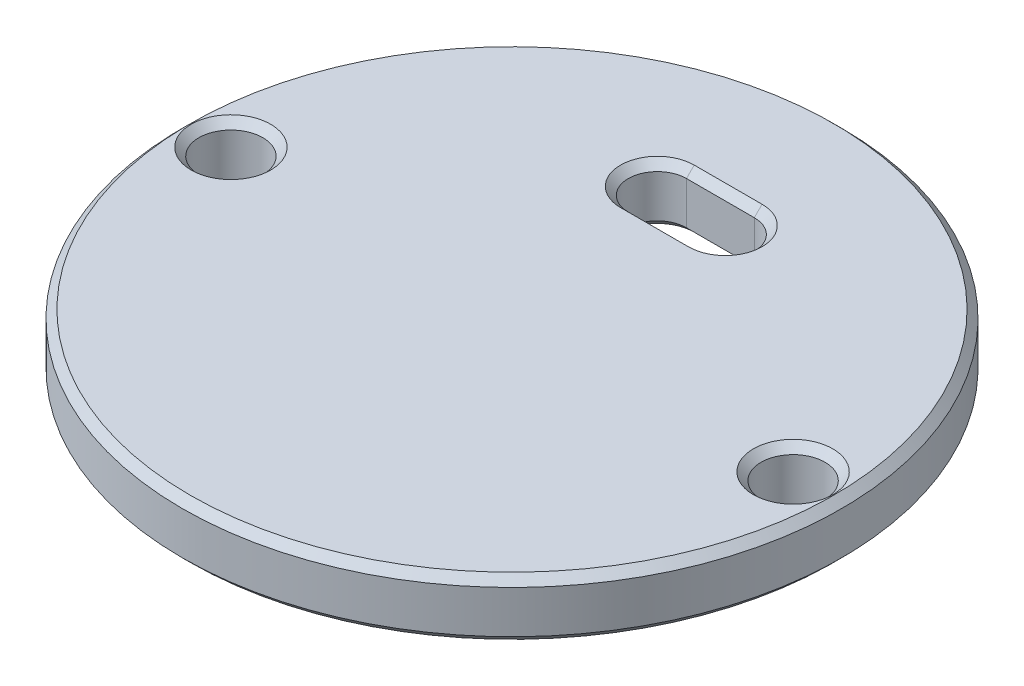
ISO-10303-21;
HEADER;
FILE_DESCRIPTION(('STEP AP214'),'2;1');
FILE_NAME('part.step','',(''),(''),'','','');
FILE_SCHEMA(('AUTOMOTIVE_DESIGN { 1 0 10303 214 1 1 1 1 }'));
ENDSEC;
DATA;
#1=APPLICATION_CONTEXT('core data for automotive mechanical design processes');
#2=APPLICATION_PROTOCOL_DEFINITION('international standard','automotive_design',2000,#1);
#3=PRODUCT_CONTEXT('',#1,'mechanical');
#4=PRODUCT('Part','Part','',(#3));
#5=PRODUCT_RELATED_PRODUCT_CATEGORY('part','',(#4));
#6=PRODUCT_DEFINITION_FORMATION('','',#4);
#7=PRODUCT_DEFINITION_CONTEXT('part definition',#1,'design');
#8=PRODUCT_DEFINITION('design','',#6,#7);
#9=PRODUCT_DEFINITION_SHAPE('','',#8);
#10=(LENGTH_UNIT() NAMED_UNIT(*) SI_UNIT(.MILLI.,.METRE.));
#11=(NAMED_UNIT(*) PLANE_ANGLE_UNIT() SI_UNIT($,.RADIAN.));
#12=(NAMED_UNIT(*) SI_UNIT($,.STERADIAN.) SOLID_ANGLE_UNIT());
#13=UNCERTAINTY_MEASURE_WITH_UNIT(LENGTH_MEASURE(1.E-05),#10,'distance_accuracy_value','');
#14=(GEOMETRIC_REPRESENTATION_CONTEXT(3) GLOBAL_UNCERTAINTY_ASSIGNED_CONTEXT((#13)) GLOBAL_UNIT_ASSIGNED_CONTEXT((#10,
#11,#12)) REPRESENTATION_CONTEXT('',''));
#15=CARTESIAN_POINT('',(0.,0.,0.));
#16=DIRECTION('',(0.,0.,1.));
#17=DIRECTION('',(1.,0.,0.));
#18=AXIS2_PLACEMENT_3D('',#15,#16,#17);
#19=CARTESIAN_POINT('',(0.,3.,0.));
#20=DIRECTION('',(0.,1.,0.));
#21=DIRECTION('',(0.,0.,1.));
#22=AXIS2_PLACEMENT_3D('',#19,#20,#21);
#23=PLANE('',#22);
#24=CARTESIAN_POINT('',(14.5,3.,0.));
#25=DIRECTION('',(0.,1.,0.));
#26=DIRECTION('',(0.,0.,1.));
#27=AXIS2_PLACEMENT_3D('',#24,#25,#26);
#28=CIRCLE('',#27,2.05);
#29=CARTESIAN_POINT('',(14.5,3.,2.05));
#30=VERTEX_POINT('',#29);
#31=EDGE_CURVE('E174',#30,#30,#28,.F.);
#32=ORIENTED_EDGE('',*,*,#31,.T.);
#33=EDGE_LOOP('',(#32));
#34=FACE_BOUND('',#33,.T.);
#35=CARTESIAN_POINT('',(1.75,3.,-9.25));
#36=DIRECTION('',(0.,1.,0.));
#37=DIRECTION('',(0.,0.,1.));
#38=AXIS2_PLACEMENT_3D('',#35,#36,#37);
#39=CIRCLE('',#38,1.90000000000002);
#40=CARTESIAN_POINT('',(1.75,3.,-11.15));
#41=VERTEX_POINT('',#40);
#42=CARTESIAN_POINT('',(1.75,3.,-7.34999999999998));
#43=VERTEX_POINT('',#42);
#44=EDGE_CURVE('E180',#41,#43,#39,.F.);
#45=ORIENTED_EDGE('',*,*,#44,.T.);
#46=DIRECTION('',(-1.,0.,0.));
#47=VECTOR('',#46,1.);
#48=CARTESIAN_POINT('',(0.,3.,-7.34999999999998));
#49=LINE('',#48,#47);
#50=CARTESIAN_POINT('',(-1.75,3.,-7.34999999999998));
#51=VERTEX_POINT('',#50);
#52=EDGE_CURVE('E177',#43,#51,#49,.T.);
#53=ORIENTED_EDGE('',*,*,#52,.T.);
#54=CARTESIAN_POINT('',(-1.75,3.,-9.25));
#55=DIRECTION('',(0.,1.,0.));
#56=DIRECTION('',(0.,0.,1.));
#57=AXIS2_PLACEMENT_3D('',#54,#55,#56);
#58=CIRCLE('',#57,1.90000000000002);
#59=CARTESIAN_POINT('',(-1.75,3.,-11.15));
#60=VERTEX_POINT('',#59);
#61=EDGE_CURVE('E182',#51,#60,#58,.F.);
#62=ORIENTED_EDGE('',*,*,#61,.T.);
#63=DIRECTION('',(1.,0.,0.));
#64=VECTOR('',#63,1.);
#65=CARTESIAN_POINT('',(0.,3.,-11.15));
#66=LINE('',#65,#64);
#67=EDGE_CURVE('E184',#60,#41,#66,.T.);
#68=ORIENTED_EDGE('',*,*,#67,.T.);
#69=EDGE_LOOP('',(#45,#53,#62,#68));
#70=FACE_BOUND('',#69,.T.);
#71=CARTESIAN_POINT('',(-14.5,3.,0.));
#72=DIRECTION('',(0.,1.,0.));
#73=DIRECTION('',(0.,0.,1.));
#74=AXIS2_PLACEMENT_3D('',#71,#72,#73);
#75=CIRCLE('',#74,2.05000000000001);
#76=CARTESIAN_POINT('',(-14.5,3.,2.05000000000001));
#77=VERTEX_POINT('',#76);
#78=EDGE_CURVE('E186',#77,#77,#75,.F.);
#79=ORIENTED_EDGE('',*,*,#78,.T.);
#80=EDGE_LOOP('',(#79));
#81=FACE_BOUND('',#80,.T.);
#82=CARTESIAN_POINT('',(0.,3.,0.));
#83=DIRECTION('',(0.,1.,0.));
#84=DIRECTION('',(0.,0.,1.));
#85=AXIS2_PLACEMENT_3D('',#82,#83,#84);
#86=CIRCLE('',#85,16.6);
#87=CARTESIAN_POINT('',(0.,3.,16.6));
#88=VERTEX_POINT('',#87);
#89=EDGE_CURVE('E189',#88,#88,#86,.T.);
#90=ORIENTED_EDGE('',*,*,#89,.T.);
#91=EDGE_LOOP('',(#90));
#92=FACE_BOUND('',#91,.T.);
#93=ADVANCED_FACE('F40',(#34,#70,#81,#92),#23,.T.);
#94=CARTESIAN_POINT('',(0.,0.,0.));
#95=DIRECTION('',(0.,1.,0.));
#96=DIRECTION('',(0.,0.,1.));
#97=AXIS2_PLACEMENT_3D('',#94,#95,#96);
#98=PLANE('',#97);
#99=CARTESIAN_POINT('',(14.5,0.,0.));
#100=DIRECTION('',(0.,1.,0.));
#101=DIRECTION('',(0.,0.,1.));
#102=AXIS2_PLACEMENT_3D('',#99,#100,#101);
#103=CIRCLE('',#102,2.05);
#104=CARTESIAN_POINT('',(14.5,0.,2.05));
#105=VERTEX_POINT('',#104);
#106=EDGE_CURVE('E198',#105,#105,#103,.T.);
#107=ORIENTED_EDGE('',*,*,#106,.T.);
#108=EDGE_LOOP('',(#107));
#109=FACE_BOUND('',#108,.T.);
#110=CARTESIAN_POINT('',(-1.75,0.,-9.25));
#111=DIRECTION('',(0.,1.,0.));
#112=DIRECTION('',(0.,0.,1.));
#113=AXIS2_PLACEMENT_3D('',#110,#111,#112);
#114=CIRCLE('',#113,1.89999999999999);
#115=CARTESIAN_POINT('',(-1.75,0.,-11.15));
#116=VERTEX_POINT('',#115);
#117=CARTESIAN_POINT('',(-1.75,0.,-7.35000000000001));
#118=VERTEX_POINT('',#117);
#119=EDGE_CURVE('E121',#116,#118,#114,.T.);
#120=ORIENTED_EDGE('',*,*,#119,.T.);
#121=DIRECTION('',(1.,0.,0.));
#122=VECTOR('',#121,1.);
#123=CARTESIAN_POINT('',(1.75,0.,-7.35000000000001));
#124=LINE('',#123,#122);
#125=CARTESIAN_POINT('',(1.75,0.,-7.35000000000001));
#126=VERTEX_POINT('',#125);
#127=EDGE_CURVE('E117',#118,#126,#124,.T.);
#128=ORIENTED_EDGE('',*,*,#127,.T.);
#129=CARTESIAN_POINT('',(1.75,0.,-9.25));
#130=DIRECTION('',(0.,1.,0.));
#131=DIRECTION('',(0.,0.,1.));
#132=AXIS2_PLACEMENT_3D('',#129,#130,#131);
#133=CIRCLE('',#132,1.89999999999999);
#134=CARTESIAN_POINT('',(1.75,0.,-11.15));
#135=VERTEX_POINT('',#134);
#136=EDGE_CURVE('E110',#126,#135,#133,.T.);
#137=ORIENTED_EDGE('',*,*,#136,.T.);
#138=DIRECTION('',(-1.,0.,0.));
#139=VECTOR('',#138,1.);
#140=CARTESIAN_POINT('',(-1.75,0.,-11.15));
#141=LINE('',#140,#139);
#142=EDGE_CURVE('E114',#135,#116,#141,.T.);
#143=ORIENTED_EDGE('',*,*,#142,.T.);
#144=EDGE_LOOP('',(#120,#128,#137,#143));
#145=FACE_BOUND('',#144,.T.);
#146=CARTESIAN_POINT('',(-14.5,0.,0.));
#147=DIRECTION('',(0.,1.,0.));
#148=DIRECTION('',(0.,0.,1.));
#149=AXIS2_PLACEMENT_3D('',#146,#147,#148);
#150=CIRCLE('',#149,2.05);
#151=CARTESIAN_POINT('',(-14.5,0.,2.05));
#152=VERTEX_POINT('',#151);
#153=EDGE_CURVE('E131',#152,#152,#150,.T.);
#154=ORIENTED_EDGE('',*,*,#153,.T.);
#155=EDGE_LOOP('',(#154));
#156=FACE_BOUND('',#155,.T.);
#157=CARTESIAN_POINT('',(0.,0.,0.));
#158=DIRECTION('',(0.,1.,0.));
#159=DIRECTION('',(0.,0.,1.));
#160=AXIS2_PLACEMENT_3D('',#157,#158,#159);
#161=CIRCLE('',#160,16.6);
#162=CARTESIAN_POINT('',(0.,0.,16.6));
#163=VERTEX_POINT('',#162);
#164=EDGE_CURVE('E205',#163,#163,#161,.F.);
#165=ORIENTED_EDGE('',*,*,#164,.T.);
#166=EDGE_LOOP('',(#165));
#167=FACE_BOUND('',#166,.T.);
#168=ADVANCED_FACE('F112',(#109,#145,#156,#167),#98,.F.);
#169=CARTESIAN_POINT('',(0.,3.,0.));
#170=DIRECTION('',(0.,-1.,0.));
#171=DIRECTION('',(0.,0.,-1.));
#172=AXIS2_PLACEMENT_3D('',#169,#170,#171);
#173=CYLINDRICAL_SURFACE('',#172,17.);
#174=CARTESIAN_POINT('',(0.,0.400000000000001,0.));
#175=DIRECTION('',(0.,1.,0.));
#176=DIRECTION('',(0.,0.,1.));
#177=AXIS2_PLACEMENT_3D('',#174,#175,#176);
#178=CIRCLE('',#177,17.);
#179=CARTESIAN_POINT('',(0.,0.400000000000001,17.));
#180=VERTEX_POINT('',#179);
#181=EDGE_CURVE('E11',#180,#180,#178,.T.);
#182=ORIENTED_EDGE('',*,*,#181,.T.);
#183=EDGE_LOOP('',(#182));
#184=FACE_BOUND('',#183,.T.);
#185=CARTESIAN_POINT('',(0.,2.60000000000001,0.));
#186=DIRECTION('',(0.,1.,0.));
#187=DIRECTION('',(0.,0.,1.));
#188=AXIS2_PLACEMENT_3D('',#185,#186,#187);
#189=CIRCLE('',#188,17.);
#190=CARTESIAN_POINT('',(0.,2.60000000000001,17.));
#191=VERTEX_POINT('',#190);
#192=EDGE_CURVE('E50',#191,#191,#189,.F.);
#193=ORIENTED_EDGE('',*,*,#192,.T.);
#194=EDGE_LOOP('',(#193));
#195=FACE_BOUND('',#194,.T.);
#196=ADVANCED_FACE('F244',(#184,#195),#173,.T.);
#197=CARTESIAN_POINT('',(1.75,3.,-9.25));
#198=DIRECTION('',(0.,-1.,0.));
#199=DIRECTION('',(0.,0.,-1.));
#200=AXIS2_PLACEMENT_3D('',#197,#198,#199);
#201=CYLINDRICAL_SURFACE('',#200,1.5);
#202=DIRECTION('',(0.,-1.,0.));
#203=VECTOR('',#202,1.);
#204=CARTESIAN_POINT('',(1.75,3.,-7.75));
#205=LINE('',#204,#203);
#206=CARTESIAN_POINT('',(1.75,2.59999999999999,-7.75));
#207=VERTEX_POINT('',#206);
#208=CARTESIAN_POINT('',(1.75,0.399999999999998,-7.75));
#209=VERTEX_POINT('',#208);
#210=EDGE_CURVE('E144',#207,#209,#205,.T.);
#211=ORIENTED_EDGE('',*,*,#210,.F.);
#212=CARTESIAN_POINT('',(1.75,2.59999999999999,-9.25));
#213=DIRECTION('',(0.,1.,0.));
#214=DIRECTION('',(0.,0.,1.));
#215=AXIS2_PLACEMENT_3D('',#212,#213,#214);
#216=CIRCLE('',#215,1.5);
#217=CARTESIAN_POINT('',(1.75,2.59999999999999,-10.75));
#218=VERTEX_POINT('',#217);
#219=EDGE_CURVE('E165',#207,#218,#216,.T.);
#220=ORIENTED_EDGE('',*,*,#219,.T.);
#221=DIRECTION('',(0.,-1.,0.));
#222=VECTOR('',#221,1.);
#223=CARTESIAN_POINT('',(1.75,3.,-10.75));
#224=LINE('',#223,#222);
#225=CARTESIAN_POINT('',(1.75,0.399999999999998,-10.75));
#226=VERTEX_POINT('',#225);
#227=EDGE_CURVE('E208',#218,#226,#224,.T.);
#228=ORIENTED_EDGE('',*,*,#227,.T.);
#229=CARTESIAN_POINT('',(1.75,0.399999999999998,-9.25));
#230=DIRECTION('',(0.,1.,0.));
#231=DIRECTION('',(0.,0.,1.));
#232=AXIS2_PLACEMENT_3D('',#229,#230,#231);
#233=CIRCLE('',#232,1.5);
#234=EDGE_CURVE('E134',#226,#209,#233,.F.);
#235=ORIENTED_EDGE('',*,*,#234,.T.);
#236=EDGE_LOOP('',(#211,#220,#228,#235));
#237=FACE_BOUND('',#236,.T.);
#238=ADVANCED_FACE('F249',(#237),#201,.F.);
#239=CARTESIAN_POINT('',(-1.75,3.,-10.75));
#240=DIRECTION('',(0.,0.,1.));
#241=DIRECTION('',(1.,0.,0.));
#242=AXIS2_PLACEMENT_3D('',#239,#240,#241);
#243=PLANE('',#242);
#244=ORIENTED_EDGE('',*,*,#227,.F.);
#245=DIRECTION('',(-1.,0.,0.));
#246=VECTOR('',#245,1.);
#247=CARTESIAN_POINT('',(-1.75,2.59999999999999,-10.75));
#248=LINE('',#247,#246);
#249=CARTESIAN_POINT('',(-1.75,2.59999999999999,-10.75));
#250=VERTEX_POINT('',#249);
#251=EDGE_CURVE('E65',#218,#250,#248,.T.);
#252=ORIENTED_EDGE('',*,*,#251,.T.);
#253=DIRECTION('',(0.,-1.,0.));
#254=VECTOR('',#253,1.);
#255=CARTESIAN_POINT('',(-1.75,3.,-10.75));
#256=LINE('',#255,#254);
#257=CARTESIAN_POINT('',(-1.75,0.399999999999998,-10.75));
#258=VERTEX_POINT('',#257);
#259=EDGE_CURVE('E211',#250,#258,#256,.T.);
#260=ORIENTED_EDGE('',*,*,#259,.T.);
#261=DIRECTION('',(1.,0.,0.));
#262=VECTOR('',#261,1.);
#263=CARTESIAN_POINT('',(1.75,0.399999999999998,-10.75));
#264=LINE('',#263,#262);
#265=EDGE_CURVE('E160',#258,#226,#264,.T.);
#266=ORIENTED_EDGE('',*,*,#265,.T.);
#267=EDGE_LOOP('',(#244,#252,#260,#266));
#268=FACE_BOUND('',#267,.T.);
#269=ADVANCED_FACE('F455',(#268),#243,.T.);
#270=CARTESIAN_POINT('',(-1.75,3.,-9.25));
#271=DIRECTION('',(0.,-1.,0.));
#272=DIRECTION('',(0.,0.,-1.));
#273=AXIS2_PLACEMENT_3D('',#270,#271,#272);
#274=CYLINDRICAL_SURFACE('',#273,1.5);
#275=ORIENTED_EDGE('',*,*,#259,.F.);
#276=CARTESIAN_POINT('',(-1.75,2.59999999999999,-9.25));
#277=DIRECTION('',(0.,1.,0.));
#278=DIRECTION('',(0.,0.,1.));
#279=AXIS2_PLACEMENT_3D('',#276,#277,#278);
#280=CIRCLE('',#279,1.5);
#281=CARTESIAN_POINT('',(-1.75,2.59999999999999,-7.75));
#282=VERTEX_POINT('',#281);
#283=EDGE_CURVE('E162',#250,#282,#280,.T.);
#284=ORIENTED_EDGE('',*,*,#283,.T.);
#285=DIRECTION('',(0.,-1.,0.));
#286=VECTOR('',#285,1.);
#287=CARTESIAN_POINT('',(-1.75,3.,-7.75));
#288=LINE('',#287,#286);
#289=CARTESIAN_POINT('',(-1.75,0.399999999999998,-7.75));
#290=VERTEX_POINT('',#289);
#291=EDGE_CURVE('E213',#282,#290,#288,.T.);
#292=ORIENTED_EDGE('',*,*,#291,.T.);
#293=CARTESIAN_POINT('',(-1.75,0.399999999999998,-9.25));
#294=DIRECTION('',(0.,1.,0.));
#295=DIRECTION('',(0.,0.,1.));
#296=AXIS2_PLACEMENT_3D('',#293,#294,#295);
#297=CIRCLE('',#296,1.5);
#298=EDGE_CURVE('E58',#290,#258,#297,.F.);
#299=ORIENTED_EDGE('',*,*,#298,.T.);
#300=EDGE_LOOP('',(#275,#284,#292,#299));
#301=FACE_BOUND('',#300,.T.);
#302=ADVANCED_FACE('F446',(#301),#274,.F.);
#303=CARTESIAN_POINT('',(-1.75,3.,-7.75));
#304=DIRECTION('',(0.,0.,-1.));
#305=DIRECTION('',(-1.,0.,0.));
#306=AXIS2_PLACEMENT_3D('',#303,#304,#305);
#307=PLANE('',#306);
#308=ORIENTED_EDGE('',*,*,#291,.F.);
#309=DIRECTION('',(1.,0.,0.));
#310=VECTOR('',#309,1.);
#311=CARTESIAN_POINT('',(-1.75,2.59999999999999,-7.75));
#312=LINE('',#311,#310);
#313=EDGE_CURVE('E168',#282,#207,#312,.T.);
#314=ORIENTED_EDGE('',*,*,#313,.T.);
#315=ORIENTED_EDGE('',*,*,#210,.T.);
#316=DIRECTION('',(-1.,0.,0.));
#317=VECTOR('',#316,1.);
#318=CARTESIAN_POINT('',(-1.75,0.399999999999998,-7.75));
#319=LINE('',#318,#317);
#320=EDGE_CURVE('E171',#209,#290,#319,.T.);
#321=ORIENTED_EDGE('',*,*,#320,.T.);
#322=EDGE_LOOP('',(#308,#314,#315,#321));
#323=FACE_BOUND('',#322,.T.);
#324=ADVANCED_FACE('F220',(#323),#307,.T.);
#325=CARTESIAN_POINT('',(-14.5,3.,0.));
#326=DIRECTION('',(0.,-1.,0.));
#327=DIRECTION('',(0.,0.,-1.));
#328=AXIS2_PLACEMENT_3D('',#325,#326,#327);
#329=CYLINDRICAL_SURFACE('',#328,1.65);
#330=CARTESIAN_POINT('',(-14.5,0.399999999999997,0.));
#331=DIRECTION('',(0.,1.,0.));
#332=DIRECTION('',(0.,0.,1.));
#333=AXIS2_PLACEMENT_3D('',#330,#331,#332);
#334=CIRCLE('',#333,1.65);
#335=CARTESIAN_POINT('',(-14.5,0.399999999999997,1.65));
#336=VERTEX_POINT('',#335);
#337=EDGE_CURVE('E153',#336,#336,#334,.F.);
#338=ORIENTED_EDGE('',*,*,#337,.T.);
#339=EDGE_LOOP('',(#338));
#340=FACE_BOUND('',#339,.T.);
#341=CARTESIAN_POINT('',(-14.5,2.59999999999999,0.));
#342=DIRECTION('',(0.,1.,0.));
#343=DIRECTION('',(0.,0.,1.));
#344=AXIS2_PLACEMENT_3D('',#341,#342,#343);
#345=CIRCLE('',#344,1.65);
#346=CARTESIAN_POINT('',(-14.5,2.59999999999999,1.65));
#347=VERTEX_POINT('',#346);
#348=EDGE_CURVE('E156',#347,#347,#345,.T.);
#349=ORIENTED_EDGE('',*,*,#348,.T.);
#350=EDGE_LOOP('',(#349));
#351=FACE_BOUND('',#350,.T.);
#352=ADVANCED_FACE('F427',(#340,#351),#329,.F.);
#353=CARTESIAN_POINT('',(14.5,3.,0.));
#354=DIRECTION('',(0.,-1.,0.));
#355=DIRECTION('',(0.,0.,-1.));
#356=AXIS2_PLACEMENT_3D('',#353,#354,#355);
#357=CYLINDRICAL_SURFACE('',#356,1.65);
#358=CARTESIAN_POINT('',(14.5,0.399999999999997,0.));
#359=DIRECTION('',(0.,1.,0.));
#360=DIRECTION('',(0.,0.,1.));
#361=AXIS2_PLACEMENT_3D('',#358,#359,#360);
#362=CIRCLE('',#361,1.65);
#363=CARTESIAN_POINT('',(14.5,0.399999999999997,1.65));
#364=VERTEX_POINT('',#363);
#365=EDGE_CURVE('E192',#364,#364,#362,.F.);
#366=ORIENTED_EDGE('',*,*,#365,.T.);
#367=EDGE_LOOP('',(#366));
#368=FACE_BOUND('',#367,.T.);
#369=CARTESIAN_POINT('',(14.5,2.60000000000001,0.));
#370=DIRECTION('',(0.,1.,0.));
#371=DIRECTION('',(0.,0.,1.));
#372=AXIS2_PLACEMENT_3D('',#369,#370,#371);
#373=CIRCLE('',#372,1.65);
#374=CARTESIAN_POINT('',(14.5,2.60000000000001,1.65));
#375=VERTEX_POINT('',#374);
#376=EDGE_CURVE('E195',#375,#375,#373,.T.);
#377=ORIENTED_EDGE('',*,*,#376,.T.);
#378=EDGE_LOOP('',(#377));
#379=FACE_BOUND('',#378,.T.);
#380=ADVANCED_FACE('F263',(#368,#379),#357,.F.);
#381=CARTESIAN_POINT('',(14.5,0.,0.));
#382=DIRECTION('',(0.,-1.,0.));
#383=DIRECTION('',(0.,0.,-1.));
#384=AXIS2_PLACEMENT_3D('',#381,#382,#383);
#385=CONICAL_SURFACE('',#384,2.05,0.785398163397456);
#386=ORIENTED_EDGE('',*,*,#365,.F.);
#387=EDGE_LOOP('',(#386));
#388=FACE_BOUND('',#387,.T.);
#389=ORIENTED_EDGE('',*,*,#106,.F.);
#390=EDGE_LOOP('',(#389));
#391=FACE_BOUND('',#390,.T.);
#392=ADVANCED_FACE('F256',(#388,#391),#385,.F.);
#393=CARTESIAN_POINT('',(14.5,2.60000000000001,0.));
#394=DIRECTION('',(0.,1.,0.));
#395=DIRECTION('',(0.,0.,1.));
#396=AXIS2_PLACEMENT_3D('',#393,#394,#395);
#397=CONICAL_SURFACE('',#396,1.65,0.785398163397459);
#398=ORIENTED_EDGE('',*,*,#31,.F.);
#399=EDGE_LOOP('',(#398));
#400=FACE_BOUND('',#399,.T.);
#401=ORIENTED_EDGE('',*,*,#376,.F.);
#402=EDGE_LOOP('',(#401));
#403=FACE_BOUND('',#402,.T.);
#404=ADVANCED_FACE('F262',(#400,#403),#397,.F.);
#405=CARTESIAN_POINT('',(-1.75,2.59999999999999,-10.75));
#406=DIRECTION('',(0.,-0.707106781186554,-0.707106781186541));
#407=DIRECTION('',(-1.,0.,0.));
#408=AXIS2_PLACEMENT_3D('',#405,#406,#407);
#409=PLANE('',#408);
#410=DIRECTION('',(0.,-0.707106781186541,0.707106781186554));
#411=VECTOR('',#410,1.);
#412=CARTESIAN_POINT('',(1.75,3.,-11.15));
#413=LINE('',#412,#411);
#414=EDGE_CURVE('E145',#41,#218,#413,.T.);
#415=ORIENTED_EDGE('',*,*,#414,.F.);
#416=ORIENTED_EDGE('',*,*,#67,.F.);
#417=DIRECTION('',(0.,0.707106781186541,-0.707106781186554));
#418=VECTOR('',#417,1.);
#419=CARTESIAN_POINT('',(-1.75,2.59999999999999,-10.75));
#420=LINE('',#419,#418);
#421=EDGE_CURVE('E141',#250,#60,#420,.T.);
#422=ORIENTED_EDGE('',*,*,#421,.F.);
#423=ORIENTED_EDGE('',*,*,#251,.F.);
#424=EDGE_LOOP('',(#415,#416,#422,#423));
#425=FACE_BOUND('',#424,.T.);
#426=ADVANCED_FACE('F270',(#425),#409,.F.);
#427=CARTESIAN_POINT('',(-1.75,2.59999999999999,-9.25));
#428=DIRECTION('',(0.,1.,0.));
#429=DIRECTION('',(0.,0.,1.));
#430=AXIS2_PLACEMENT_3D('',#427,#428,#429);
#431=CONICAL_SURFACE('',#430,1.5,0.785398163397457);
#432=ORIENTED_EDGE('',*,*,#421,.T.);
#433=ORIENTED_EDGE('',*,*,#61,.F.);
#434=DIRECTION('',(0.,0.707106781186541,0.707106781186554));
#435=VECTOR('',#434,1.);
#436=CARTESIAN_POINT('',(-1.75,2.59999999999999,-7.75));
#437=LINE('',#436,#435);
#438=EDGE_CURVE('E148',#282,#51,#437,.T.);
#439=ORIENTED_EDGE('',*,*,#438,.F.);
#440=ORIENTED_EDGE('',*,*,#283,.F.);
#441=EDGE_LOOP('',(#432,#433,#439,#440));
#442=FACE_BOUND('',#441,.T.);
#443=ADVANCED_FACE('F286',(#442),#431,.F.);
#444=CARTESIAN_POINT('',(1.75,2.59999999999999,-9.25));
#445=DIRECTION('',(0.,1.,0.));
#446=DIRECTION('',(0.,0.,1.));
#447=AXIS2_PLACEMENT_3D('',#444,#445,#446);
#448=CONICAL_SURFACE('',#447,1.5,0.785398163397457);
#449=ORIENTED_EDGE('',*,*,#414,.T.);
#450=ORIENTED_EDGE('',*,*,#219,.F.);
#451=DIRECTION('',(0.,-0.707106781186541,-0.707106781186554));
#452=VECTOR('',#451,1.);
#453=CARTESIAN_POINT('',(1.75,3.,-7.34999999999998));
#454=LINE('',#453,#452);
#455=EDGE_CURVE('E136',#43,#207,#454,.T.);
#456=ORIENTED_EDGE('',*,*,#455,.F.);
#457=ORIENTED_EDGE('',*,*,#44,.F.);
#458=EDGE_LOOP('',(#449,#450,#456,#457));
#459=FACE_BOUND('',#458,.T.);
#460=ADVANCED_FACE('F279',(#459),#448,.F.);
#461=CARTESIAN_POINT('',(-1.75,2.59999999999999,-7.75));
#462=DIRECTION('',(0.,-0.707106781186554,0.707106781186541));
#463=DIRECTION('',(1.,0.,0.));
#464=AXIS2_PLACEMENT_3D('',#461,#462,#463);
#465=PLANE('',#464);
#466=ORIENTED_EDGE('',*,*,#438,.T.);
#467=ORIENTED_EDGE('',*,*,#52,.F.);
#468=ORIENTED_EDGE('',*,*,#455,.T.);
#469=ORIENTED_EDGE('',*,*,#313,.F.);
#470=EDGE_LOOP('',(#466,#467,#468,#469));
#471=FACE_BOUND('',#470,.T.);
#472=ADVANCED_FACE('F235',(#471),#465,.F.);
#473=CARTESIAN_POINT('',(0.,0.,-11.15));
#474=DIRECTION('',(0.,-0.707106781186541,0.707106781186554));
#475=DIRECTION('',(1.,0.,0.));
#476=AXIS2_PLACEMENT_3D('',#473,#474,#475);
#477=PLANE('',#476);
#478=DIRECTION('',(0.,-0.707106781186554,-0.707106781186541));
#479=VECTOR('',#478,1.);
#480=CARTESIAN_POINT('',(1.75,0.399999999999998,-10.75));
#481=LINE('',#480,#479);
#482=EDGE_CURVE('E127',#226,#135,#481,.T.);
#483=ORIENTED_EDGE('',*,*,#482,.F.);
#484=ORIENTED_EDGE('',*,*,#265,.F.);
#485=DIRECTION('',(0.,0.707106781186554,0.707106781186541));
#486=VECTOR('',#485,1.);
#487=CARTESIAN_POINT('',(-1.75,0.,-11.15));
#488=LINE('',#487,#486);
#489=EDGE_CURVE('E45',#116,#258,#488,.T.);
#490=ORIENTED_EDGE('',*,*,#489,.F.);
#491=ORIENTED_EDGE('',*,*,#142,.F.);
#492=EDGE_LOOP('',(#483,#484,#490,#491));
#493=FACE_BOUND('',#492,.T.);
#494=ADVANCED_FACE('F125',(#493),#477,.T.);
#495=CARTESIAN_POINT('',(-1.75,0.,-9.25));
#496=DIRECTION('',(0.,-1.,0.));
#497=DIRECTION('',(0.,0.,-1.));
#498=AXIS2_PLACEMENT_3D('',#495,#496,#497);
#499=CONICAL_SURFACE('',#498,1.89999999999999,0.78539816339744);
#500=ORIENTED_EDGE('',*,*,#489,.T.);
#501=ORIENTED_EDGE('',*,*,#298,.F.);
#502=DIRECTION('',(0.,0.707106781186554,-0.707106781186541));
#503=VECTOR('',#502,1.);
#504=CARTESIAN_POINT('',(-1.75,0.,-7.35000000000001));
#505=LINE('',#504,#503);
#506=EDGE_CURVE('E135',#118,#290,#505,.T.);
#507=ORIENTED_EDGE('',*,*,#506,.F.);
#508=ORIENTED_EDGE('',*,*,#119,.F.);
#509=EDGE_LOOP('',(#500,#501,#507,#508));
#510=FACE_BOUND('',#509,.T.);
#511=ADVANCED_FACE('F227',(#510),#499,.F.);
#512=CARTESIAN_POINT('',(1.75,0.,-9.25));
#513=DIRECTION('',(0.,-1.,0.));
#514=DIRECTION('',(0.,0.,-1.));
#515=AXIS2_PLACEMENT_3D('',#512,#513,#514);
#516=CONICAL_SURFACE('',#515,1.89999999999999,0.78539816339744);
#517=ORIENTED_EDGE('',*,*,#482,.T.);
#518=ORIENTED_EDGE('',*,*,#136,.F.);
#519=DIRECTION('',(0.,-0.707106781186554,0.707106781186541));
#520=VECTOR('',#519,1.);
#521=CARTESIAN_POINT('',(1.75,0.399999999999998,-7.75));
#522=LINE('',#521,#520);
#523=EDGE_CURVE('E137',#209,#126,#522,.T.);
#524=ORIENTED_EDGE('',*,*,#523,.F.);
#525=ORIENTED_EDGE('',*,*,#234,.F.);
#526=EDGE_LOOP('',(#517,#518,#524,#525));
#527=FACE_BOUND('',#526,.T.);
#528=ADVANCED_FACE('F133',(#527),#516,.F.);
#529=CARTESIAN_POINT('',(0.,0.,-7.35000000000001));
#530=DIRECTION('',(0.,-0.707106781186541,-0.707106781186554));
#531=DIRECTION('',(-1.,0.,0.));
#532=AXIS2_PLACEMENT_3D('',#529,#530,#531);
#533=PLANE('',#532);
#534=ORIENTED_EDGE('',*,*,#506,.T.);
#535=ORIENTED_EDGE('',*,*,#320,.F.);
#536=ORIENTED_EDGE('',*,*,#523,.T.);
#537=ORIENTED_EDGE('',*,*,#127,.F.);
#538=EDGE_LOOP('',(#534,#535,#536,#537));
#539=FACE_BOUND('',#538,.T.);
#540=ADVANCED_FACE('F224',(#539),#533,.T.);
#541=CARTESIAN_POINT('',(-14.5,0.,0.));
#542=DIRECTION('',(0.,-1.,0.));
#543=DIRECTION('',(0.,0.,-1.));
#544=AXIS2_PLACEMENT_3D('',#541,#542,#543);
#545=CONICAL_SURFACE('',#544,2.05,0.785398163397456);
#546=ORIENTED_EDGE('',*,*,#337,.F.);
#547=EDGE_LOOP('',(#546));
#548=FACE_BOUND('',#547,.T.);
#549=ORIENTED_EDGE('',*,*,#153,.F.);
#550=EDGE_LOOP('',(#549));
#551=FACE_BOUND('',#550,.T.);
#552=ADVANCED_FACE('F304',(#548,#551),#545,.F.);
#553=CARTESIAN_POINT('',(-14.5,2.59999999999999,0.));
#554=DIRECTION('',(0.,1.,0.));
#555=DIRECTION('',(0.,0.,1.));
#556=AXIS2_PLACEMENT_3D('',#553,#554,#555);
#557=CONICAL_SURFACE('',#556,1.65,0.78539816339745);
#558=ORIENTED_EDGE('',*,*,#78,.F.);
#559=EDGE_LOOP('',(#558));
#560=FACE_BOUND('',#559,.T.);
#561=ORIENTED_EDGE('',*,*,#348,.F.);
#562=EDGE_LOOP('',(#561));
#563=FACE_BOUND('',#562,.T.);
#564=ADVANCED_FACE('F317',(#560,#563),#557,.F.);
#565=CARTESIAN_POINT('',(0.,0.400000000000001,0.));
#566=DIRECTION('',(0.,1.,0.));
#567=DIRECTION('',(0.,0.,1.));
#568=AXIS2_PLACEMENT_3D('',#565,#566,#567);
#569=CONICAL_SURFACE('',#568,17.,0.785398163397448);
#570=ORIENTED_EDGE('',*,*,#164,.F.);
#571=EDGE_LOOP('',(#570));
#572=FACE_BOUND('',#571,.T.);
#573=ORIENTED_EDGE('',*,*,#181,.F.);
#574=EDGE_LOOP('',(#573));
#575=FACE_BOUND('',#574,.T.);
#576=ADVANCED_FACE('F323',(#572,#575),#569,.T.);
#577=CARTESIAN_POINT('',(0.,3.,0.));
#578=DIRECTION('',(0.,-1.,0.));
#579=DIRECTION('',(0.,0.,-1.));
#580=AXIS2_PLACEMENT_3D('',#577,#578,#579);
#581=CONICAL_SURFACE('',#580,16.6,0.785398163397444);
#582=ORIENTED_EDGE('',*,*,#192,.F.);
#583=EDGE_LOOP('',(#582));
#584=FACE_BOUND('',#583,.T.);
#585=ORIENTED_EDGE('',*,*,#89,.F.);
#586=EDGE_LOOP('',(#585));
#587=FACE_BOUND('',#586,.T.);
#588=ADVANCED_FACE('F43',(#584,#587),#581,.T.);
#589=CLOSED_SHELL('',(#93,#168,#196,#238,#269,#302,#324,#352,#380,#392,#404,#426,#443,#460,#472,
#494,#511,#528,#540,#552,#564,#576,#588));
#590=MANIFOLD_SOLID_BREP('B2',#589);
#591=ADVANCED_BREP_SHAPE_REPRESENTATION('',(#18,#590),#14);
#592=SHAPE_DEFINITION_REPRESENTATION(#9,#591);
ENDSEC;
END-ISO-10303-21;
